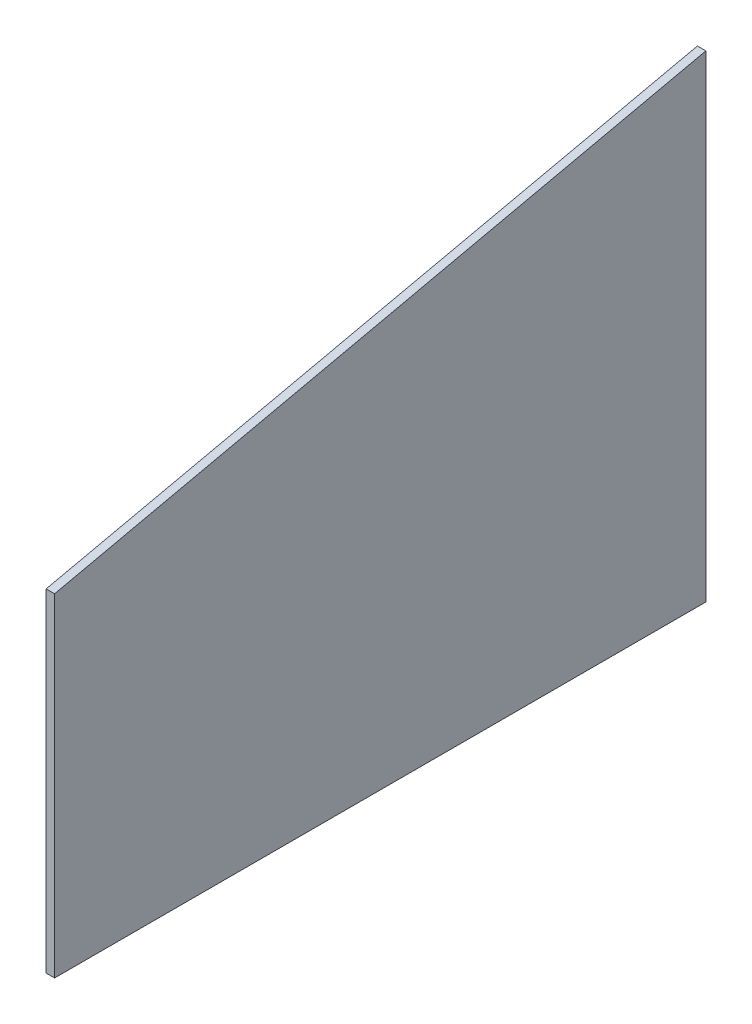
ISO-10303-21;
HEADER;
FILE_DESCRIPTION(('STEP AP214'),'2;1');
FILE_NAME('part.step','',(''),(''),'','','');
FILE_SCHEMA(('AUTOMOTIVE_DESIGN { 1 0 10303 214 1 1 1 1 }'));
ENDSEC;
DATA;
#1=APPLICATION_CONTEXT('core data for automotive mechanical design processes');
#2=APPLICATION_PROTOCOL_DEFINITION('international standard','automotive_design',2000,#1);
#3=PRODUCT_CONTEXT('',#1,'mechanical');
#4=PRODUCT('Part','Part','',(#3));
#5=PRODUCT_RELATED_PRODUCT_CATEGORY('part','',(#4));
#6=PRODUCT_DEFINITION_FORMATION('','',#4);
#7=PRODUCT_DEFINITION_CONTEXT('part definition',#1,'design');
#8=PRODUCT_DEFINITION('design','',#6,#7);
#9=PRODUCT_DEFINITION_SHAPE('','',#8);
#10=(LENGTH_UNIT() NAMED_UNIT(*) SI_UNIT(.MILLI.,.METRE.));
#11=(NAMED_UNIT(*) PLANE_ANGLE_UNIT() SI_UNIT($,.RADIAN.));
#12=(NAMED_UNIT(*) SI_UNIT($,.STERADIAN.) SOLID_ANGLE_UNIT());
#13=UNCERTAINTY_MEASURE_WITH_UNIT(LENGTH_MEASURE(1.E-05),#10,'distance_accuracy_value','');
#14=(GEOMETRIC_REPRESENTATION_CONTEXT(3) GLOBAL_UNCERTAINTY_ASSIGNED_CONTEXT((#13)) GLOBAL_UNIT_ASSIGNED_CONTEXT((#10,
#11,#12)) REPRESENTATION_CONTEXT('',''));
#15=CARTESIAN_POINT('',(0.,0.,0.));
#16=DIRECTION('',(0.,0.,1.));
#17=DIRECTION('',(1.,0.,0.));
#18=AXIS2_PLACEMENT_3D('',#15,#16,#17);
#19=CARTESIAN_POINT('',(2.54,100.584,0.));
#20=DIRECTION('',(0.,0.,-1.));
#21=DIRECTION('',(-1.,0.,0.));
#22=AXIS2_PLACEMENT_3D('',#19,#20,#21);
#23=PLANE('',#22);
#24=DIRECTION('',(0.,-1.,0.));
#25=VECTOR('',#24,1.);
#26=CARTESIAN_POINT('',(0.,100.584,0.));
#27=LINE('',#26,#25);
#28=CARTESIAN_POINT('',(0.,100.584,0.));
#29=VERTEX_POINT('',#28);
#30=CARTESIAN_POINT('',(0.,0.,0.));
#31=VERTEX_POINT('',#30);
#32=EDGE_CURVE('E96',#29,#31,#27,.T.);
#33=ORIENTED_EDGE('',*,*,#32,.T.);
#34=DIRECTION('',(-1.,0.,0.));
#35=VECTOR('',#34,1.);
#36=CARTESIAN_POINT('',(2.54,0.,0.));
#37=LINE('',#36,#35);
#38=CARTESIAN_POINT('',(2.54,0.,0.));
#39=VERTEX_POINT('',#38);
#40=EDGE_CURVE('E11',#39,#31,#37,.T.);
#41=ORIENTED_EDGE('',*,*,#40,.F.);
#42=DIRECTION('',(0.,-1.,0.));
#43=VECTOR('',#42,1.);
#44=CARTESIAN_POINT('',(2.54,100.584,0.));
#45=LINE('',#44,#43);
#46=CARTESIAN_POINT('',(2.54,100.584,0.));
#47=VERTEX_POINT('',#46);
#48=EDGE_CURVE('E84',#47,#39,#45,.T.);
#49=ORIENTED_EDGE('',*,*,#48,.F.);
#50=DIRECTION('',(-1.,0.,0.));
#51=VECTOR('',#50,1.);
#52=CARTESIAN_POINT('',(2.54,100.584,0.));
#53=LINE('',#52,#51);
#54=EDGE_CURVE('E92',#47,#29,#53,.T.);
#55=ORIENTED_EDGE('',*,*,#54,.T.);
#56=EDGE_LOOP('',(#33,#41,#49,#55));
#57=FACE_BOUND('',#56,.T.);
#58=ADVANCED_FACE('F33',(#57),#23,.F.);
#59=CARTESIAN_POINT('',(2.54,0.,0.));
#60=DIRECTION('',(0.,1.,0.));
#61=DIRECTION('',(0.,0.,1.));
#62=AXIS2_PLACEMENT_3D('',#59,#60,#61);
#63=PLANE('',#62);
#64=DIRECTION('',(0.,0.,-1.));
#65=VECTOR('',#64,1.);
#66=CARTESIAN_POINT('',(0.,0.,0.));
#67=LINE('',#66,#65);
#68=CARTESIAN_POINT('',(0.,0.,-196.85));
#69=VERTEX_POINT('',#68);
#70=EDGE_CURVE('E88',#31,#69,#67,.T.);
#71=ORIENTED_EDGE('',*,*,#70,.T.);
#72=DIRECTION('',(-1.,0.,0.));
#73=VECTOR('',#72,1.);
#74=CARTESIAN_POINT('',(2.54,0.,-196.85));
#75=LINE('',#74,#73);
#76=CARTESIAN_POINT('',(2.54,0.,-196.85));
#77=VERTEX_POINT('',#76);
#78=EDGE_CURVE('E41',#77,#69,#75,.T.);
#79=ORIENTED_EDGE('',*,*,#78,.F.);
#80=DIRECTION('',(0.,0.,-1.));
#81=VECTOR('',#80,1.);
#82=CARTESIAN_POINT('',(2.54,0.,0.));
#83=LINE('',#82,#81);
#84=EDGE_CURVE('E79',#39,#77,#83,.T.);
#85=ORIENTED_EDGE('',*,*,#84,.F.);
#86=ORIENTED_EDGE('',*,*,#40,.T.);
#87=EDGE_LOOP('',(#71,#79,#85,#86));
#88=FACE_BOUND('',#87,.T.);
#89=ADVANCED_FACE('F87',(#88),#63,.F.);
#90=CARTESIAN_POINT('',(2.54,0.,-196.85));
#91=DIRECTION('',(0.,0.,1.));
#92=DIRECTION('',(1.,0.,0.));
#93=AXIS2_PLACEMENT_3D('',#90,#91,#92);
#94=PLANE('',#93);
#95=DIRECTION('',(0.,1.,0.));
#96=VECTOR('',#95,1.);
#97=CARTESIAN_POINT('',(0.,0.,-196.85));
#98=LINE('',#97,#96);
#99=CARTESIAN_POINT('',(0.,144.272,-196.85));
#100=VERTEX_POINT('',#99);
#101=EDGE_CURVE('E66',#69,#100,#98,.T.);
#102=ORIENTED_EDGE('',*,*,#101,.T.);
#103=DIRECTION('',(-1.,0.,0.));
#104=VECTOR('',#103,1.);
#105=CARTESIAN_POINT('',(2.54,144.272,-196.85));
#106=LINE('',#105,#104);
#107=CARTESIAN_POINT('',(2.54,144.272,-196.85));
#108=VERTEX_POINT('',#107);
#109=EDGE_CURVE('E89',#108,#100,#106,.T.);
#110=ORIENTED_EDGE('',*,*,#109,.F.);
#111=DIRECTION('',(0.,1.,0.));
#112=VECTOR('',#111,1.);
#113=CARTESIAN_POINT('',(2.54,0.,-196.85));
#114=LINE('',#113,#112);
#115=EDGE_CURVE('E82',#77,#108,#114,.T.);
#116=ORIENTED_EDGE('',*,*,#115,.F.);
#117=ORIENTED_EDGE('',*,*,#78,.T.);
#118=EDGE_LOOP('',(#102,#110,#116,#117));
#119=FACE_BOUND('',#118,.T.);
#120=ADVANCED_FACE('F90',(#119),#94,.F.);
#121=CARTESIAN_POINT('',(2.54,144.272,-196.85));
#122=DIRECTION('',(0.,-0.976246302450005,-0.216663695511485));
#123=DIRECTION('',(0.,0.216663695511485,-0.976246302450005));
#124=AXIS2_PLACEMENT_3D('',#121,#122,#123);
#125=PLANE('',#124);
#126=DIRECTION('',(0.,-0.216663695511485,0.976246302450005));
#127=VECTOR('',#126,1.);
#128=CARTESIAN_POINT('',(0.,144.272,-196.85));
#129=LINE('',#128,#127);
#130=EDGE_CURVE('E72',#100,#29,#129,.T.);
#131=ORIENTED_EDGE('',*,*,#130,.T.);
#132=ORIENTED_EDGE('',*,*,#54,.F.);
#133=DIRECTION('',(0.,-0.216663695511485,0.976246302450005));
#134=VECTOR('',#133,1.);
#135=CARTESIAN_POINT('',(2.54,144.272,-196.85));
#136=LINE('',#135,#134);
#137=EDGE_CURVE('E49',#108,#47,#136,.T.);
#138=ORIENTED_EDGE('',*,*,#137,.F.);
#139=ORIENTED_EDGE('',*,*,#109,.T.);
#140=EDGE_LOOP('',(#131,#132,#138,#139));
#141=FACE_BOUND('',#140,.T.);
#142=ADVANCED_FACE('F103',(#141),#125,.F.);
#143=CARTESIAN_POINT('',(2.54,0.,0.));
#144=DIRECTION('',(1.,0.,0.));
#145=DIRECTION('',(0.,0.,-1.));
#146=AXIS2_PLACEMENT_3D('',#143,#144,#145);
#147=PLANE('',#146);
#148=ORIENTED_EDGE('',*,*,#48,.T.);
#149=ORIENTED_EDGE('',*,*,#84,.T.);
#150=ORIENTED_EDGE('',*,*,#115,.T.);
#151=ORIENTED_EDGE('',*,*,#137,.T.);
#152=EDGE_LOOP('',(#148,#149,#150,#151));
#153=FACE_BOUND('',#152,.T.);
#154=ADVANCED_FACE('F80',(#153),#147,.T.);
#155=CARTESIAN_POINT('',(0.,0.,0.));
#156=DIRECTION('',(1.,0.,0.));
#157=DIRECTION('',(0.,0.,-1.));
#158=AXIS2_PLACEMENT_3D('',#155,#156,#157);
#159=PLANE('',#158);
#160=ORIENTED_EDGE('',*,*,#32,.F.);
#161=ORIENTED_EDGE('',*,*,#130,.F.);
#162=ORIENTED_EDGE('',*,*,#101,.F.);
#163=ORIENTED_EDGE('',*,*,#70,.F.);
#164=EDGE_LOOP('',(#160,#161,#162,#163));
#165=FACE_BOUND('',#164,.T.);
#166=ADVANCED_FACE('F106',(#165),#159,.F.);
#167=CLOSED_SHELL('',(#58,#89,#120,#142,#154,#166));
#168=MANIFOLD_SOLID_BREP('B2',#167);
#169=ADVANCED_BREP_SHAPE_REPRESENTATION('',(#18,#168),#14);
#170=SHAPE_DEFINITION_REPRESENTATION(#9,#169);
ENDSEC;
END-ISO-10303-21;
